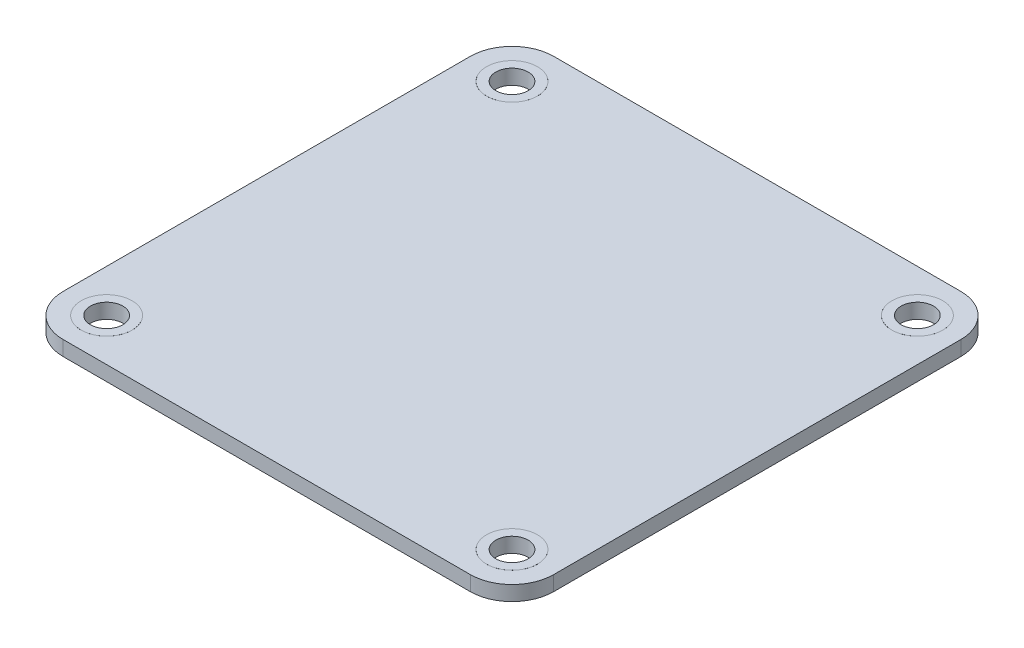
ISO-10303-21;
HEADER;
FILE_DESCRIPTION(('STEP AP214'),'2;1');
FILE_NAME('part.step','',(''),(''),'','','');
FILE_SCHEMA(('AUTOMOTIVE_DESIGN { 1 0 10303 214 1 1 1 1 }'));
ENDSEC;
DATA;
#1=APPLICATION_CONTEXT('core data for automotive mechanical design processes');
#2=APPLICATION_PROTOCOL_DEFINITION('international standard','automotive_design',2000,#1);
#3=PRODUCT_CONTEXT('',#1,'mechanical');
#4=PRODUCT('Part','Part','',(#3));
#5=PRODUCT_RELATED_PRODUCT_CATEGORY('part','',(#4));
#6=PRODUCT_DEFINITION_FORMATION('','',#4);
#7=PRODUCT_DEFINITION_CONTEXT('part definition',#1,'design');
#8=PRODUCT_DEFINITION('design','',#6,#7);
#9=PRODUCT_DEFINITION_SHAPE('','',#8);
#10=(LENGTH_UNIT() NAMED_UNIT(*) SI_UNIT(.MILLI.,.METRE.));
#11=(NAMED_UNIT(*) PLANE_ANGLE_UNIT() SI_UNIT($,.RADIAN.));
#12=(NAMED_UNIT(*) SI_UNIT($,.STERADIAN.) SOLID_ANGLE_UNIT());
#13=UNCERTAINTY_MEASURE_WITH_UNIT(LENGTH_MEASURE(1.E-05),#10,'distance_accuracy_value','');
#14=(GEOMETRIC_REPRESENTATION_CONTEXT(3) GLOBAL_UNCERTAINTY_ASSIGNED_CONTEXT((#13)) GLOBAL_UNIT_ASSIGNED_CONTEXT((#10,
#11,#12)) REPRESENTATION_CONTEXT('',''));
#15=CARTESIAN_POINT('',(0.,0.,0.));
#16=DIRECTION('',(0.,0.,1.));
#17=DIRECTION('',(1.,0.,0.));
#18=AXIS2_PLACEMENT_3D('',#15,#16,#17);
#19=CARTESIAN_POINT('',(-22.,1.6,-22.));
#20=DIRECTION('',(0.,-1.,0.));
#21=DIRECTION('',(0.,0.,-1.));
#22=AXIS2_PLACEMENT_3D('',#19,#20,#21);
#23=PLANE('',#22);
#24=CARTESIAN_POINT('',(21.9,1.6,21.9));
#25=DIRECTION('',(0.,-1.,0.));
#26=DIRECTION('',(0.,0.,-1.));
#27=AXIS2_PLACEMENT_3D('',#24,#25,#26);
#28=CIRCLE('',#27,2.75);
#29=CARTESIAN_POINT('',(21.9,1.6,19.15));
#30=VERTEX_POINT('',#29);
#31=EDGE_CURVE('E43',#30,#30,#28,.F.);
#32=ORIENTED_EDGE('',*,*,#31,.F.);
#33=EDGE_LOOP('',(#32));
#34=FACE_BOUND('',#33,.T.);
#35=CARTESIAN_POINT('',(-21.9,1.6,-21.9));
#36=DIRECTION('',(0.,-1.,0.));
#37=DIRECTION('',(0.,0.,-1.));
#38=AXIS2_PLACEMENT_3D('',#35,#36,#37);
#39=CIRCLE('',#38,2.75);
#40=CARTESIAN_POINT('',(-21.9,1.6,-24.65));
#41=VERTEX_POINT('',#40);
#42=EDGE_CURVE('E163',#41,#41,#39,.F.);
#43=ORIENTED_EDGE('',*,*,#42,.F.);
#44=EDGE_LOOP('',(#43));
#45=FACE_BOUND('',#44,.T.);
#46=CARTESIAN_POINT('',(-22.,1.6,-22.));
#47=DIRECTION('',(0.,1.,0.));
#48=DIRECTION('',(0.,0.,-1.));
#49=AXIS2_PLACEMENT_3D('',#46,#47,#48);
#50=CIRCLE('',#49,4.5);
#51=CARTESIAN_POINT('',(-22.,1.6,-26.5));
#52=VERTEX_POINT('',#51);
#53=CARTESIAN_POINT('',(-26.5,1.6,-22.));
#54=VERTEX_POINT('',#53);
#55=EDGE_CURVE('E148',#52,#54,#50,.T.);
#56=ORIENTED_EDGE('',*,*,#55,.T.);
#57=DIRECTION('',(0.,0.,1.));
#58=VECTOR('',#57,1.);
#59=CARTESIAN_POINT('',(-26.5,1.6,22.));
#60=LINE('',#59,#58);
#61=CARTESIAN_POINT('',(-26.5,1.6,22.));
#62=VERTEX_POINT('',#61);
#63=EDGE_CURVE('E96',#54,#62,#60,.T.);
#64=ORIENTED_EDGE('',*,*,#63,.T.);
#65=CARTESIAN_POINT('',(-22.,1.6,22.));
#66=DIRECTION('',(0.,1.,0.));
#67=DIRECTION('',(0.,0.,-1.));
#68=AXIS2_PLACEMENT_3D('',#65,#66,#67);
#69=CIRCLE('',#68,4.5);
#70=CARTESIAN_POINT('',(-22.,1.6,26.5));
#71=VERTEX_POINT('',#70);
#72=EDGE_CURVE('E218',#62,#71,#69,.T.);
#73=ORIENTED_EDGE('',*,*,#72,.T.);
#74=DIRECTION('',(1.,0.,0.));
#75=VECTOR('',#74,1.);
#76=CARTESIAN_POINT('',(22.,1.6,26.5));
#77=LINE('',#76,#75);
#78=CARTESIAN_POINT('',(22.,1.6,26.5));
#79=VERTEX_POINT('',#78);
#80=EDGE_CURVE('E220',#71,#79,#77,.T.);
#81=ORIENTED_EDGE('',*,*,#80,.T.);
#82=CARTESIAN_POINT('',(22.,1.6,22.));
#83=DIRECTION('',(0.,1.,0.));
#84=DIRECTION('',(0.,0.,-1.));
#85=AXIS2_PLACEMENT_3D('',#82,#83,#84);
#86=CIRCLE('',#85,4.5);
#87=CARTESIAN_POINT('',(26.5,1.6,22.));
#88=VERTEX_POINT('',#87);
#89=EDGE_CURVE('E115',#79,#88,#86,.T.);
#90=ORIENTED_EDGE('',*,*,#89,.T.);
#91=DIRECTION('',(0.,0.,-1.));
#92=VECTOR('',#91,1.);
#93=CARTESIAN_POINT('',(26.5,1.6,22.));
#94=LINE('',#93,#92);
#95=CARTESIAN_POINT('',(26.5,1.6,-22.));
#96=VERTEX_POINT('',#95);
#97=EDGE_CURVE('E109',#88,#96,#94,.T.);
#98=ORIENTED_EDGE('',*,*,#97,.T.);
#99=CARTESIAN_POINT('',(22.,1.6,-22.));
#100=DIRECTION('',(0.,1.,0.));
#101=DIRECTION('',(0.,0.,-1.));
#102=AXIS2_PLACEMENT_3D('',#99,#100,#101);
#103=CIRCLE('',#102,4.5);
#104=CARTESIAN_POINT('',(22.,1.6,-26.5));
#105=VERTEX_POINT('',#104);
#106=EDGE_CURVE('E113',#96,#105,#103,.T.);
#107=ORIENTED_EDGE('',*,*,#106,.T.);
#108=DIRECTION('',(-1.,0.,0.));
#109=VECTOR('',#108,1.);
#110=CARTESIAN_POINT('',(22.,1.6,-26.5));
#111=LINE('',#110,#109);
#112=EDGE_CURVE('E52',#105,#52,#111,.T.);
#113=ORIENTED_EDGE('',*,*,#112,.T.);
#114=EDGE_LOOP('',(#56,#64,#73,#81,#90,#98,#107,#113));
#115=FACE_BOUND('',#114,.T.);
#116=CARTESIAN_POINT('',(21.9,1.6,-21.9));
#117=DIRECTION('',(0.,-1.,0.));
#118=DIRECTION('',(0.,0.,-1.));
#119=AXIS2_PLACEMENT_3D('',#116,#117,#118);
#120=CIRCLE('',#119,2.75);
#121=CARTESIAN_POINT('',(21.9,1.6,-24.65));
#122=VERTEX_POINT('',#121);
#123=EDGE_CURVE('E194',#122,#122,#120,.F.);
#124=ORIENTED_EDGE('',*,*,#123,.F.);
#125=EDGE_LOOP('',(#124));
#126=FACE_BOUND('',#125,.T.);
#127=CARTESIAN_POINT('',(-21.9,1.6,21.9));
#128=DIRECTION('',(0.,-1.,0.));
#129=DIRECTION('',(0.,0.,-1.));
#130=AXIS2_PLACEMENT_3D('',#127,#128,#129);
#131=CIRCLE('',#130,2.75);
#132=CARTESIAN_POINT('',(-21.9,1.6,19.15));
#133=VERTEX_POINT('',#132);
#134=EDGE_CURVE('E11',#133,#133,#131,.F.);
#135=ORIENTED_EDGE('',*,*,#134,.F.);
#136=EDGE_LOOP('',(#135));
#137=FACE_BOUND('',#136,.T.);
#138=ADVANCED_FACE('F33',(#34,#45,#115,#126,#137),#23,.F.);
#139=CARTESIAN_POINT('',(-22.,0.,-22.));
#140=DIRECTION('',(0.,-1.,0.));
#141=DIRECTION('',(0.,0.,-1.));
#142=AXIS2_PLACEMENT_3D('',#139,#140,#141);
#143=PLANE('',#142);
#144=CARTESIAN_POINT('',(21.9,0.,21.9));
#145=DIRECTION('',(0.,-1.,0.));
#146=DIRECTION('',(0.,0.,-1.));
#147=AXIS2_PLACEMENT_3D('',#144,#145,#146);
#148=CIRCLE('',#147,2.75);
#149=CARTESIAN_POINT('',(21.9,0.,19.15));
#150=VERTEX_POINT('',#149);
#151=EDGE_CURVE('E171',#150,#150,#148,.F.);
#152=ORIENTED_EDGE('',*,*,#151,.T.);
#153=EDGE_LOOP('',(#152));
#154=FACE_BOUND('',#153,.T.);
#155=CARTESIAN_POINT('',(-21.9,0.,-21.9));
#156=DIRECTION('',(0.,-1.,0.));
#157=DIRECTION('',(0.,0.,-1.));
#158=AXIS2_PLACEMENT_3D('',#155,#156,#157);
#159=CIRCLE('',#158,2.75);
#160=CARTESIAN_POINT('',(-21.9,0.,-24.65));
#161=VERTEX_POINT('',#160);
#162=EDGE_CURVE('E137',#161,#161,#159,.F.);
#163=ORIENTED_EDGE('',*,*,#162,.T.);
#164=EDGE_LOOP('',(#163));
#165=FACE_BOUND('',#164,.T.);
#166=CARTESIAN_POINT('',(-22.,0.,-22.));
#167=DIRECTION('',(0.,1.,0.));
#168=DIRECTION('',(0.,0.,-1.));
#169=AXIS2_PLACEMENT_3D('',#166,#167,#168);
#170=CIRCLE('',#169,4.5);
#171=CARTESIAN_POINT('',(-22.,0.,-26.5));
#172=VERTEX_POINT('',#171);
#173=CARTESIAN_POINT('',(-26.5,0.,-22.));
#174=VERTEX_POINT('',#173);
#175=EDGE_CURVE('E133',#172,#174,#170,.T.);
#176=ORIENTED_EDGE('',*,*,#175,.F.);
#177=DIRECTION('',(-1.,0.,0.));
#178=VECTOR('',#177,1.);
#179=CARTESIAN_POINT('',(22.,0.,-26.5));
#180=LINE('',#179,#178);
#181=CARTESIAN_POINT('',(22.,0.,-26.5));
#182=VERTEX_POINT('',#181);
#183=EDGE_CURVE('E87',#182,#172,#180,.T.);
#184=ORIENTED_EDGE('',*,*,#183,.F.);
#185=CARTESIAN_POINT('',(22.,0.,-22.));
#186=DIRECTION('',(0.,1.,0.));
#187=DIRECTION('',(0.,0.,-1.));
#188=AXIS2_PLACEMENT_3D('',#185,#186,#187);
#189=CIRCLE('',#188,4.5);
#190=CARTESIAN_POINT('',(26.5,0.,-22.));
#191=VERTEX_POINT('',#190);
#192=EDGE_CURVE('E81',#191,#182,#189,.T.);
#193=ORIENTED_EDGE('',*,*,#192,.F.);
#194=DIRECTION('',(0.,0.,-1.));
#195=VECTOR('',#194,1.);
#196=CARTESIAN_POINT('',(26.5,0.,22.));
#197=LINE('',#196,#195);
#198=CARTESIAN_POINT('',(26.5,0.,22.));
#199=VERTEX_POINT('',#198);
#200=EDGE_CURVE('E123',#199,#191,#197,.T.);
#201=ORIENTED_EDGE('',*,*,#200,.F.);
#202=CARTESIAN_POINT('',(22.,0.,22.));
#203=DIRECTION('',(0.,1.,0.));
#204=DIRECTION('',(0.,0.,-1.));
#205=AXIS2_PLACEMENT_3D('',#202,#203,#204);
#206=CIRCLE('',#205,4.5);
#207=CARTESIAN_POINT('',(22.,0.,26.5));
#208=VERTEX_POINT('',#207);
#209=EDGE_CURVE('E143',#208,#199,#206,.T.);
#210=ORIENTED_EDGE('',*,*,#209,.F.);
#211=DIRECTION('',(1.,0.,0.));
#212=VECTOR('',#211,1.);
#213=CARTESIAN_POINT('',(22.,0.,26.5));
#214=LINE('',#213,#212);
#215=CARTESIAN_POINT('',(-22.,0.,26.5));
#216=VERTEX_POINT('',#215);
#217=EDGE_CURVE('E141',#216,#208,#214,.T.);
#218=ORIENTED_EDGE('',*,*,#217,.F.);
#219=CARTESIAN_POINT('',(-22.,0.,22.));
#220=DIRECTION('',(0.,1.,0.));
#221=DIRECTION('',(0.,0.,-1.));
#222=AXIS2_PLACEMENT_3D('',#219,#220,#221);
#223=CIRCLE('',#222,4.5);
#224=CARTESIAN_POINT('',(-26.5,0.,22.));
#225=VERTEX_POINT('',#224);
#226=EDGE_CURVE('E139',#225,#216,#223,.T.);
#227=ORIENTED_EDGE('',*,*,#226,.F.);
#228=DIRECTION('',(0.,0.,1.));
#229=VECTOR('',#228,1.);
#230=CARTESIAN_POINT('',(-26.5,0.,22.));
#231=LINE('',#230,#229);
#232=EDGE_CURVE('E136',#174,#225,#231,.T.);
#233=ORIENTED_EDGE('',*,*,#232,.F.);
#234=EDGE_LOOP('',(#176,#184,#193,#201,#210,#218,#227,#233));
#235=FACE_BOUND('',#234,.T.);
#236=CARTESIAN_POINT('',(21.9,0.,-21.9));
#237=DIRECTION('',(0.,-1.,0.));
#238=DIRECTION('',(0.,0.,-1.));
#239=AXIS2_PLACEMENT_3D('',#236,#237,#238);
#240=CIRCLE('',#239,2.75);
#241=CARTESIAN_POINT('',(21.9,0.,-24.65));
#242=VERTEX_POINT('',#241);
#243=EDGE_CURVE('E167',#242,#242,#240,.F.);
#244=ORIENTED_EDGE('',*,*,#243,.T.);
#245=EDGE_LOOP('',(#244));
#246=FACE_BOUND('',#245,.T.);
#247=CARTESIAN_POINT('',(-21.9,0.,21.9));
#248=DIRECTION('',(0.,-1.,0.));
#249=DIRECTION('',(0.,0.,-1.));
#250=AXIS2_PLACEMENT_3D('',#247,#248,#249);
#251=CIRCLE('',#250,2.75);
#252=CARTESIAN_POINT('',(-21.9,0.,19.15));
#253=VERTEX_POINT('',#252);
#254=EDGE_CURVE('E37',#253,#253,#251,.F.);
#255=ORIENTED_EDGE('',*,*,#254,.T.);
#256=EDGE_LOOP('',(#255));
#257=FACE_BOUND('',#256,.T.);
#258=ADVANCED_FACE('F233',(#154,#165,#235,#246,#257),#143,.T.);
#259=CARTESIAN_POINT('',(-21.9,1.605,-21.9));
#260=DIRECTION('',(0.,-1.,0.));
#261=DIRECTION('',(0.,0.,-1.));
#262=AXIS2_PLACEMENT_3D('',#259,#260,#261);
#263=CYLINDRICAL_SURFACE('',#262,2.75);
#264=CARTESIAN_POINT('',(-21.9,1.605,-21.9));
#265=DIRECTION('',(0.,1.,0.));
#266=DIRECTION('',(0.,0.,1.));
#267=AXIS2_PLACEMENT_3D('',#264,#265,#266);
#268=CIRCLE('',#267,2.75);
#269=CARTESIAN_POINT('',(-21.9,1.605,-19.15));
#270=VERTEX_POINT('',#269);
#271=EDGE_CURVE('E166',#270,#270,#268,.T.);
#272=ORIENTED_EDGE('',*,*,#271,.F.);
#273=EDGE_LOOP('',(#272));
#274=FACE_BOUND('',#273,.T.);
#275=ORIENTED_EDGE('',*,*,#42,.T.);
#276=EDGE_LOOP('',(#275));
#277=FACE_BOUND('',#276,.T.);
#278=ADVANCED_FACE('F259',(#274,#277),#263,.T.);
#279=CARTESIAN_POINT('',(-21.9,1.605,-21.9));
#280=DIRECTION('',(0.,1.,0.));
#281=DIRECTION('',(0.,0.,1.));
#282=AXIS2_PLACEMENT_3D('',#279,#280,#281);
#283=PLANE('',#282);
#284=ORIENTED_EDGE('',*,*,#271,.T.);
#285=EDGE_LOOP('',(#284));
#286=FACE_BOUND('',#285,.T.);
#287=CARTESIAN_POINT('',(-21.9,1.605,-21.9));
#288=DIRECTION('',(0.,1.,0.));
#289=DIRECTION('',(0.,0.,1.));
#290=AXIS2_PLACEMENT_3D('',#287,#288,#289);
#291=CIRCLE('',#290,1.75);
#292=CARTESIAN_POINT('',(-21.9,1.605,-20.15));
#293=VERTEX_POINT('',#292);
#294=EDGE_CURVE('E204',#293,#293,#291,.T.);
#295=ORIENTED_EDGE('',*,*,#294,.F.);
#296=EDGE_LOOP('',(#295));
#297=FACE_BOUND('',#296,.T.);
#298=ADVANCED_FACE('F271',(#286,#297),#283,.T.);
#299=CARTESIAN_POINT('',(-21.9,-0.00500000000000001,-21.9));
#300=DIRECTION('',(0.,1.,0.));
#301=DIRECTION('',(0.,0.,1.));
#302=AXIS2_PLACEMENT_3D('',#299,#300,#301);
#303=PLANE('',#302);
#304=CARTESIAN_POINT('',(-21.9,-0.00500000000000001,-21.9));
#305=DIRECTION('',(0.,1.,0.));
#306=DIRECTION('',(0.,0.,1.));
#307=AXIS2_PLACEMENT_3D('',#304,#305,#306);
#308=CIRCLE('',#307,2.75);
#309=CARTESIAN_POINT('',(-21.9,-0.00500000000000001,-19.15));
#310=VERTEX_POINT('',#309);
#311=EDGE_CURVE('E207',#310,#310,#308,.T.);
#312=ORIENTED_EDGE('',*,*,#311,.F.);
#313=EDGE_LOOP('',(#312));
#314=FACE_BOUND('',#313,.T.);
#315=CARTESIAN_POINT('',(-21.9,-0.00500000000000001,-21.9));
#316=DIRECTION('',(0.,1.,0.));
#317=DIRECTION('',(0.,0.,1.));
#318=AXIS2_PLACEMENT_3D('',#315,#316,#317);
#319=CIRCLE('',#318,1.75);
#320=CARTESIAN_POINT('',(-21.9,-0.00500000000000001,-20.15));
#321=VERTEX_POINT('',#320);
#322=EDGE_CURVE('E169',#321,#321,#319,.T.);
#323=ORIENTED_EDGE('',*,*,#322,.T.);
#324=EDGE_LOOP('',(#323));
#325=FACE_BOUND('',#324,.T.);
#326=ADVANCED_FACE('F267',(#314,#325),#303,.F.);
#327=ORIENTED_EDGE('',*,*,#162,.F.);
#328=EDGE_LOOP('',(#327));
#329=FACE_BOUND('',#328,.T.);
#330=ORIENTED_EDGE('',*,*,#311,.T.);
#331=EDGE_LOOP('',(#330));
#332=FACE_BOUND('',#331,.T.);
#333=ADVANCED_FACE('F263',(#329,#332),#263,.T.);
#334=CARTESIAN_POINT('',(-21.9,1.605,-21.9));
#335=DIRECTION('',(0.,-1.,0.));
#336=DIRECTION('',(0.,0.,-1.));
#337=AXIS2_PLACEMENT_3D('',#334,#335,#336);
#338=CYLINDRICAL_SURFACE('',#337,1.75);
#339=ORIENTED_EDGE('',*,*,#294,.T.);
#340=EDGE_LOOP('',(#339));
#341=FACE_BOUND('',#340,.T.);
#342=ORIENTED_EDGE('',*,*,#322,.F.);
#343=EDGE_LOOP('',(#342));
#344=FACE_BOUND('',#343,.T.);
#345=ADVANCED_FACE('F266',(#341,#344),#338,.F.);
#346=CARTESIAN_POINT('',(-22.,1.6,-22.));
#347=DIRECTION('',(0.,-1.,0.));
#348=DIRECTION('',(0.,0.,-1.));
#349=AXIS2_PLACEMENT_3D('',#346,#347,#348);
#350=CYLINDRICAL_SURFACE('',#349,4.5);
#351=ORIENTED_EDGE('',*,*,#175,.T.);
#352=DIRECTION('',(0.,-1.,0.));
#353=VECTOR('',#352,1.);
#354=CARTESIAN_POINT('',(-26.5,1.6,-22.));
#355=LINE('',#354,#353);
#356=EDGE_CURVE('E161',#54,#174,#355,.T.);
#357=ORIENTED_EDGE('',*,*,#356,.F.);
#358=ORIENTED_EDGE('',*,*,#55,.F.);
#359=DIRECTION('',(0.,-1.,0.));
#360=VECTOR('',#359,1.);
#361=CARTESIAN_POINT('',(-22.,1.6,-26.5));
#362=LINE('',#361,#360);
#363=EDGE_CURVE('E129',#52,#172,#362,.T.);
#364=ORIENTED_EDGE('',*,*,#363,.T.);
#365=EDGE_LOOP('',(#351,#357,#358,#364));
#366=FACE_BOUND('',#365,.T.);
#367=ADVANCED_FACE('F35',(#366),#350,.T.);
#368=CARTESIAN_POINT('',(-26.5,1.6,22.));
#369=DIRECTION('',(1.,0.,0.));
#370=DIRECTION('',(0.,0.,-1.));
#371=AXIS2_PLACEMENT_3D('',#368,#369,#370);
#372=PLANE('',#371);
#373=ORIENTED_EDGE('',*,*,#232,.T.);
#374=DIRECTION('',(0.,-1.,0.));
#375=VECTOR('',#374,1.);
#376=CARTESIAN_POINT('',(-26.5,1.6,22.));
#377=LINE('',#376,#375);
#378=EDGE_CURVE('E158',#62,#225,#377,.T.);
#379=ORIENTED_EDGE('',*,*,#378,.F.);
#380=ORIENTED_EDGE('',*,*,#63,.F.);
#381=ORIENTED_EDGE('',*,*,#356,.T.);
#382=EDGE_LOOP('',(#373,#379,#380,#381));
#383=FACE_BOUND('',#382,.T.);
#384=ADVANCED_FACE('F515',(#383),#372,.F.);
#385=CARTESIAN_POINT('',(-22.,1.6,22.));
#386=DIRECTION('',(0.,-1.,0.));
#387=DIRECTION('',(0.,0.,-1.));
#388=AXIS2_PLACEMENT_3D('',#385,#386,#387);
#389=CYLINDRICAL_SURFACE('',#388,4.5);
#390=ORIENTED_EDGE('',*,*,#226,.T.);
#391=DIRECTION('',(0.,-1.,0.));
#392=VECTOR('',#391,1.);
#393=CARTESIAN_POINT('',(-22.,1.6,26.5));
#394=LINE('',#393,#392);
#395=EDGE_CURVE('E155',#71,#216,#394,.T.);
#396=ORIENTED_EDGE('',*,*,#395,.F.);
#397=ORIENTED_EDGE('',*,*,#72,.F.);
#398=ORIENTED_EDGE('',*,*,#378,.T.);
#399=EDGE_LOOP('',(#390,#396,#397,#398));
#400=FACE_BOUND('',#399,.T.);
#401=ADVANCED_FACE('F507',(#400),#389,.T.);
#402=CARTESIAN_POINT('',(22.,1.6,26.5));
#403=DIRECTION('',(0.,0.,-1.));
#404=DIRECTION('',(-1.,0.,0.));
#405=AXIS2_PLACEMENT_3D('',#402,#403,#404);
#406=PLANE('',#405);
#407=ORIENTED_EDGE('',*,*,#217,.T.);
#408=DIRECTION('',(0.,-1.,0.));
#409=VECTOR('',#408,1.);
#410=CARTESIAN_POINT('',(22.,1.6,26.5));
#411=LINE('',#410,#409);
#412=EDGE_CURVE('E152',#79,#208,#411,.T.);
#413=ORIENTED_EDGE('',*,*,#412,.F.);
#414=ORIENTED_EDGE('',*,*,#80,.F.);
#415=ORIENTED_EDGE('',*,*,#395,.T.);
#416=EDGE_LOOP('',(#407,#413,#414,#415));
#417=FACE_BOUND('',#416,.T.);
#418=ADVANCED_FACE('F226',(#417),#406,.F.);
#419=CARTESIAN_POINT('',(22.,1.6,22.));
#420=DIRECTION('',(0.,-1.,0.));
#421=DIRECTION('',(0.,0.,-1.));
#422=AXIS2_PLACEMENT_3D('',#419,#420,#421);
#423=CYLINDRICAL_SURFACE('',#422,4.5);
#424=ORIENTED_EDGE('',*,*,#209,.T.);
#425=DIRECTION('',(0.,-1.,0.));
#426=VECTOR('',#425,1.);
#427=CARTESIAN_POINT('',(26.5,1.6,22.));
#428=LINE('',#427,#426);
#429=EDGE_CURVE('E124',#88,#199,#428,.T.);
#430=ORIENTED_EDGE('',*,*,#429,.F.);
#431=ORIENTED_EDGE('',*,*,#89,.F.);
#432=ORIENTED_EDGE('',*,*,#412,.T.);
#433=EDGE_LOOP('',(#424,#430,#431,#432));
#434=FACE_BOUND('',#433,.T.);
#435=ADVANCED_FACE('F230',(#434),#423,.T.);
#436=CARTESIAN_POINT('',(26.5,1.6,22.));
#437=DIRECTION('',(-1.,0.,0.));
#438=DIRECTION('',(0.,0.,1.));
#439=AXIS2_PLACEMENT_3D('',#436,#437,#438);
#440=PLANE('',#439);
#441=ORIENTED_EDGE('',*,*,#200,.T.);
#442=DIRECTION('',(0.,-1.,0.));
#443=VECTOR('',#442,1.);
#444=CARTESIAN_POINT('',(26.5,1.6,-22.));
#445=LINE('',#444,#443);
#446=EDGE_CURVE('E120',#96,#191,#445,.T.);
#447=ORIENTED_EDGE('',*,*,#446,.F.);
#448=ORIENTED_EDGE('',*,*,#97,.F.);
#449=ORIENTED_EDGE('',*,*,#429,.T.);
#450=EDGE_LOOP('',(#441,#447,#448,#449));
#451=FACE_BOUND('',#450,.T.);
#452=ADVANCED_FACE('F121',(#451),#440,.F.);
#453=CARTESIAN_POINT('',(22.,1.6,-22.));
#454=DIRECTION('',(0.,-1.,0.));
#455=DIRECTION('',(0.,0.,-1.));
#456=AXIS2_PLACEMENT_3D('',#453,#454,#455);
#457=CYLINDRICAL_SURFACE('',#456,4.5);
#458=ORIENTED_EDGE('',*,*,#192,.T.);
#459=DIRECTION('',(0.,-1.,0.));
#460=VECTOR('',#459,1.);
#461=CARTESIAN_POINT('',(22.,1.6,-26.5));
#462=LINE('',#461,#460);
#463=EDGE_CURVE('E125',#105,#182,#462,.T.);
#464=ORIENTED_EDGE('',*,*,#463,.F.);
#465=ORIENTED_EDGE('',*,*,#106,.F.);
#466=ORIENTED_EDGE('',*,*,#446,.T.);
#467=EDGE_LOOP('',(#458,#464,#465,#466));
#468=FACE_BOUND('',#467,.T.);
#469=ADVANCED_FACE('F127',(#468),#457,.T.);
#470=CARTESIAN_POINT('',(22.,1.6,-26.5));
#471=DIRECTION('',(0.,0.,1.));
#472=DIRECTION('',(1.,0.,0.));
#473=AXIS2_PLACEMENT_3D('',#470,#471,#472);
#474=PLANE('',#473);
#475=ORIENTED_EDGE('',*,*,#183,.T.);
#476=ORIENTED_EDGE('',*,*,#363,.F.);
#477=ORIENTED_EDGE('',*,*,#112,.F.);
#478=ORIENTED_EDGE('',*,*,#463,.T.);
#479=EDGE_LOOP('',(#475,#476,#477,#478));
#480=FACE_BOUND('',#479,.T.);
#481=ADVANCED_FACE('F239',(#480),#474,.F.);
#482=CARTESIAN_POINT('',(21.9,1.605,-21.9));
#483=DIRECTION('',(0.,-1.,0.));
#484=DIRECTION('',(0.,0.,-1.));
#485=AXIS2_PLACEMENT_3D('',#482,#483,#484);
#486=CYLINDRICAL_SURFACE('',#485,2.75);
#487=CARTESIAN_POINT('',(21.9,1.605,-21.9));
#488=DIRECTION('',(0.,1.,0.));
#489=DIRECTION('',(0.,0.,1.));
#490=AXIS2_PLACEMENT_3D('',#487,#488,#489);
#491=CIRCLE('',#490,2.75);
#492=CARTESIAN_POINT('',(21.9,1.605,-19.15));
#493=VERTEX_POINT('',#492);
#494=EDGE_CURVE('E170',#493,#493,#491,.T.);
#495=ORIENTED_EDGE('',*,*,#494,.F.);
#496=EDGE_LOOP('',(#495));
#497=FACE_BOUND('',#496,.T.);
#498=ORIENTED_EDGE('',*,*,#123,.T.);
#499=EDGE_LOOP('',(#498));
#500=FACE_BOUND('',#499,.T.);
#501=ADVANCED_FACE('F241',(#497,#500),#486,.T.);
#502=CARTESIAN_POINT('',(21.9,1.605,-21.9));
#503=DIRECTION('',(0.,1.,0.));
#504=DIRECTION('',(0.,0.,1.));
#505=AXIS2_PLACEMENT_3D('',#502,#503,#504);
#506=PLANE('',#505);
#507=ORIENTED_EDGE('',*,*,#494,.T.);
#508=EDGE_LOOP('',(#507));
#509=FACE_BOUND('',#508,.T.);
#510=CARTESIAN_POINT('',(21.9,1.605,-21.9));
#511=DIRECTION('',(0.,1.,0.));
#512=DIRECTION('',(0.,0.,1.));
#513=AXIS2_PLACEMENT_3D('',#510,#511,#512);
#514=CIRCLE('',#513,1.75);
#515=CARTESIAN_POINT('',(21.9,1.605,-20.15));
#516=VERTEX_POINT('',#515);
#517=EDGE_CURVE('E178',#516,#516,#514,.T.);
#518=ORIENTED_EDGE('',*,*,#517,.F.);
#519=EDGE_LOOP('',(#518));
#520=FACE_BOUND('',#519,.T.);
#521=ADVANCED_FACE('F247',(#509,#520),#506,.T.);
#522=CARTESIAN_POINT('',(21.9,-0.00500000000000001,-21.9));
#523=DIRECTION('',(0.,1.,0.));
#524=DIRECTION('',(0.,0.,1.));
#525=AXIS2_PLACEMENT_3D('',#522,#523,#524);
#526=PLANE('',#525);
#527=CARTESIAN_POINT('',(21.9,-0.00500000000000001,-21.9));
#528=DIRECTION('',(0.,1.,0.));
#529=DIRECTION('',(0.,0.,1.));
#530=AXIS2_PLACEMENT_3D('',#527,#528,#529);
#531=CIRCLE('',#530,2.75);
#532=CARTESIAN_POINT('',(21.9,-0.00500000000000001,-19.15));
#533=VERTEX_POINT('',#532);
#534=EDGE_CURVE('E196',#533,#533,#531,.T.);
#535=ORIENTED_EDGE('',*,*,#534,.F.);
#536=EDGE_LOOP('',(#535));
#537=FACE_BOUND('',#536,.T.);
#538=CARTESIAN_POINT('',(21.9,-0.00500000000000001,-21.9));
#539=DIRECTION('',(0.,1.,0.));
#540=DIRECTION('',(0.,0.,1.));
#541=AXIS2_PLACEMENT_3D('',#538,#539,#540);
#542=CIRCLE('',#541,1.75);
#543=CARTESIAN_POINT('',(21.9,-0.00500000000000001,-20.15));
#544=VERTEX_POINT('',#543);
#545=EDGE_CURVE('E173',#544,#544,#542,.T.);
#546=ORIENTED_EDGE('',*,*,#545,.T.);
#547=EDGE_LOOP('',(#546));
#548=FACE_BOUND('',#547,.T.);
#549=ADVANCED_FACE('F281',(#537,#548),#526,.F.);
#550=ORIENTED_EDGE('',*,*,#243,.F.);
#551=EDGE_LOOP('',(#550));
#552=FACE_BOUND('',#551,.T.);
#553=ORIENTED_EDGE('',*,*,#534,.T.);
#554=EDGE_LOOP('',(#553));
#555=FACE_BOUND('',#554,.T.);
#556=ADVANCED_FACE('F250',(#552,#555),#486,.T.);
#557=CARTESIAN_POINT('',(21.9,1.605,-21.9));
#558=DIRECTION('',(0.,-1.,0.));
#559=DIRECTION('',(0.,0.,-1.));
#560=AXIS2_PLACEMENT_3D('',#557,#558,#559);
#561=CYLINDRICAL_SURFACE('',#560,1.75);
#562=ORIENTED_EDGE('',*,*,#517,.T.);
#563=EDGE_LOOP('',(#562));
#564=FACE_BOUND('',#563,.T.);
#565=ORIENTED_EDGE('',*,*,#545,.F.);
#566=EDGE_LOOP('',(#565));
#567=FACE_BOUND('',#566,.T.);
#568=ADVANCED_FACE('F280',(#564,#567),#561,.F.);
#569=CARTESIAN_POINT('',(21.9,1.605,21.9));
#570=DIRECTION('',(0.,-1.,0.));
#571=DIRECTION('',(0.,0.,-1.));
#572=AXIS2_PLACEMENT_3D('',#569,#570,#571);
#573=CYLINDRICAL_SURFACE('',#572,2.75);
#574=CARTESIAN_POINT('',(21.9,1.605,21.9));
#575=DIRECTION('',(0.,1.,0.));
#576=DIRECTION('',(0.,0.,1.));
#577=AXIS2_PLACEMENT_3D('',#574,#575,#576);
#578=CIRCLE('',#577,2.75);
#579=CARTESIAN_POINT('',(21.9,1.605,24.65));
#580=VERTEX_POINT('',#579);
#581=EDGE_CURVE('E174',#580,#580,#578,.T.);
#582=ORIENTED_EDGE('',*,*,#581,.F.);
#583=EDGE_LOOP('',(#582));
#584=FACE_BOUND('',#583,.T.);
#585=ORIENTED_EDGE('',*,*,#31,.T.);
#586=EDGE_LOOP('',(#585));
#587=FACE_BOUND('',#586,.T.);
#588=ADVANCED_FACE('F291',(#584,#587),#573,.T.);
#589=CARTESIAN_POINT('',(21.9,1.605,21.9));
#590=DIRECTION('',(0.,1.,0.));
#591=DIRECTION('',(0.,0.,1.));
#592=AXIS2_PLACEMENT_3D('',#589,#590,#591);
#593=PLANE('',#592);
#594=ORIENTED_EDGE('',*,*,#581,.T.);
#595=EDGE_LOOP('',(#594));
#596=FACE_BOUND('',#595,.T.);
#597=CARTESIAN_POINT('',(21.9,1.605,21.9));
#598=DIRECTION('',(0.,1.,0.));
#599=DIRECTION('',(0.,0.,1.));
#600=AXIS2_PLACEMENT_3D('',#597,#598,#599);
#601=CIRCLE('',#600,1.75);
#602=CARTESIAN_POINT('',(21.9,1.605,23.65));
#603=VERTEX_POINT('',#602);
#604=EDGE_CURVE('E186',#603,#603,#601,.T.);
#605=ORIENTED_EDGE('',*,*,#604,.F.);
#606=EDGE_LOOP('',(#605));
#607=FACE_BOUND('',#606,.T.);
#608=ADVANCED_FACE('F301',(#596,#607),#593,.T.);
#609=CARTESIAN_POINT('',(21.9,-0.00500000000000001,21.9));
#610=DIRECTION('',(0.,1.,0.));
#611=DIRECTION('',(0.,0.,1.));
#612=AXIS2_PLACEMENT_3D('',#609,#610,#611);
#613=PLANE('',#612);
#614=CARTESIAN_POINT('',(21.9,-0.00500000000000001,21.9));
#615=DIRECTION('',(0.,1.,0.));
#616=DIRECTION('',(0.,0.,1.));
#617=AXIS2_PLACEMENT_3D('',#614,#615,#616);
#618=CIRCLE('',#617,2.75);
#619=CARTESIAN_POINT('',(21.9,-0.00500000000000001,24.65));
#620=VERTEX_POINT('',#619);
#621=EDGE_CURVE('E181',#620,#620,#618,.T.);
#622=ORIENTED_EDGE('',*,*,#621,.F.);
#623=EDGE_LOOP('',(#622));
#624=FACE_BOUND('',#623,.T.);
#625=CARTESIAN_POINT('',(21.9,-0.00500000000000001,21.9));
#626=DIRECTION('',(0.,1.,0.));
#627=DIRECTION('',(0.,0.,1.));
#628=AXIS2_PLACEMENT_3D('',#625,#626,#627);
#629=CIRCLE('',#628,1.75);
#630=CARTESIAN_POINT('',(21.9,-0.00500000000000001,23.65));
#631=VERTEX_POINT('',#630);
#632=EDGE_CURVE('E189',#631,#631,#629,.T.);
#633=ORIENTED_EDGE('',*,*,#632,.T.);
#634=EDGE_LOOP('',(#633));
#635=FACE_BOUND('',#634,.T.);
#636=ADVANCED_FACE('F297',(#624,#635),#613,.F.);
#637=ORIENTED_EDGE('',*,*,#151,.F.);
#638=EDGE_LOOP('',(#637));
#639=FACE_BOUND('',#638,.T.);
#640=ORIENTED_EDGE('',*,*,#621,.T.);
#641=EDGE_LOOP('',(#640));
#642=FACE_BOUND('',#641,.T.);
#643=ADVANCED_FACE('F293',(#639,#642),#573,.T.);
#644=CARTESIAN_POINT('',(21.9,1.605,21.9));
#645=DIRECTION('',(0.,-1.,0.));
#646=DIRECTION('',(0.,0.,-1.));
#647=AXIS2_PLACEMENT_3D('',#644,#645,#646);
#648=CYLINDRICAL_SURFACE('',#647,1.75);
#649=ORIENTED_EDGE('',*,*,#604,.T.);
#650=EDGE_LOOP('',(#649));
#651=FACE_BOUND('',#650,.T.);
#652=ORIENTED_EDGE('',*,*,#632,.F.);
#653=EDGE_LOOP('',(#652));
#654=FACE_BOUND('',#653,.T.);
#655=ADVANCED_FACE('F296',(#651,#654),#648,.F.);
#656=CARTESIAN_POINT('',(-21.9,1.605,21.9));
#657=DIRECTION('',(0.,-1.,0.));
#658=DIRECTION('',(0.,0.,-1.));
#659=AXIS2_PLACEMENT_3D('',#656,#657,#658);
#660=CYLINDRICAL_SURFACE('',#659,2.75);
#661=CARTESIAN_POINT('',(-21.9,1.605,21.9));
#662=DIRECTION('',(0.,1.,0.));
#663=DIRECTION('',(0.,0.,1.));
#664=AXIS2_PLACEMENT_3D('',#661,#662,#663);
#665=CIRCLE('',#664,2.75);
#666=CARTESIAN_POINT('',(-21.9,1.605,24.65));
#667=VERTEX_POINT('',#666);
#668=EDGE_CURVE('E338',#667,#667,#665,.T.);
#669=ORIENTED_EDGE('',*,*,#668,.F.);
#670=EDGE_LOOP('',(#669));
#671=FACE_BOUND('',#670,.T.);
#672=ORIENTED_EDGE('',*,*,#134,.T.);
#673=EDGE_LOOP('',(#672));
#674=FACE_BOUND('',#673,.T.);
#675=ADVANCED_FACE('F307',(#671,#674),#660,.T.);
#676=CARTESIAN_POINT('',(-21.9,1.605,21.9));
#677=DIRECTION('',(0.,1.,0.));
#678=DIRECTION('',(0.,0.,1.));
#679=AXIS2_PLACEMENT_3D('',#676,#677,#678);
#680=PLANE('',#679);
#681=ORIENTED_EDGE('',*,*,#668,.T.);
#682=EDGE_LOOP('',(#681));
#683=FACE_BOUND('',#682,.T.);
#684=CARTESIAN_POINT('',(-21.9,1.605,21.9));
#685=DIRECTION('',(0.,1.,0.));
#686=DIRECTION('',(0.,0.,1.));
#687=AXIS2_PLACEMENT_3D('',#684,#685,#686);
#688=CIRCLE('',#687,1.75);
#689=CARTESIAN_POINT('',(-21.9,1.605,23.65));
#690=VERTEX_POINT('',#689);
#691=EDGE_CURVE('E329',#690,#690,#688,.T.);
#692=ORIENTED_EDGE('',*,*,#691,.F.);
#693=EDGE_LOOP('',(#692));
#694=FACE_BOUND('',#693,.T.);
#695=ADVANCED_FACE('F317',(#683,#694),#680,.T.);
#696=CARTESIAN_POINT('',(-21.9,-0.00500000000000001,21.9));
#697=DIRECTION('',(0.,1.,0.));
#698=DIRECTION('',(0.,0.,1.));
#699=AXIS2_PLACEMENT_3D('',#696,#697,#698);
#700=PLANE('',#699);
#701=CARTESIAN_POINT('',(-21.9,-0.00500000000000001,21.9));
#702=DIRECTION('',(0.,1.,0.));
#703=DIRECTION('',(0.,0.,1.));
#704=AXIS2_PLACEMENT_3D('',#701,#702,#703);
#705=CIRCLE('',#704,2.75);
#706=CARTESIAN_POINT('',(-21.9,-0.00500000000000001,24.65));
#707=VERTEX_POINT('',#706);
#708=EDGE_CURVE('E335',#707,#707,#705,.T.);
#709=ORIENTED_EDGE('',*,*,#708,.F.);
#710=EDGE_LOOP('',(#709));
#711=FACE_BOUND('',#710,.T.);
#712=CARTESIAN_POINT('',(-21.9,-0.00500000000000001,21.9));
#713=DIRECTION('',(0.,1.,0.));
#714=DIRECTION('',(0.,0.,1.));
#715=AXIS2_PLACEMENT_3D('',#712,#713,#714);
#716=CIRCLE('',#715,1.75);
#717=CARTESIAN_POINT('',(-21.9,-0.00500000000000001,23.65));
#718=VERTEX_POINT('',#717);
#719=EDGE_CURVE('E332',#718,#718,#716,.T.);
#720=ORIENTED_EDGE('',*,*,#719,.T.);
#721=EDGE_LOOP('',(#720));
#722=FACE_BOUND('',#721,.T.);
#723=ADVANCED_FACE('F313',(#711,#722),#700,.F.);
#724=ORIENTED_EDGE('',*,*,#254,.F.);
#725=EDGE_LOOP('',(#724));
#726=FACE_BOUND('',#725,.T.);
#727=ORIENTED_EDGE('',*,*,#708,.T.);
#728=EDGE_LOOP('',(#727));
#729=FACE_BOUND('',#728,.T.);
#730=ADVANCED_FACE('F309',(#726,#729),#660,.T.);
#731=CARTESIAN_POINT('',(-21.9,1.605,21.9));
#732=DIRECTION('',(0.,-1.,0.));
#733=DIRECTION('',(0.,0.,-1.));
#734=AXIS2_PLACEMENT_3D('',#731,#732,#733);
#735=CYLINDRICAL_SURFACE('',#734,1.75);
#736=ORIENTED_EDGE('',*,*,#691,.T.);
#737=EDGE_LOOP('',(#736));
#738=FACE_BOUND('',#737,.T.);
#739=ORIENTED_EDGE('',*,*,#719,.F.);
#740=EDGE_LOOP('',(#739));
#741=FACE_BOUND('',#740,.T.);
#742=ADVANCED_FACE('F312',(#738,#741),#735,.F.);
#743=CLOSED_SHELL('',(#138,#258,#278,#298,#326,#333,#345,#367,#384,#401,#418,#435,#452,#469,
#481,#501,#521,#549,#556,#568,#588,#608,#636,#643,#655,#675,#695,#723,#730,#742));
#744=MANIFOLD_SOLID_BREP('B2',#743);
#745=ADVANCED_BREP_SHAPE_REPRESENTATION('',(#18,#744),#14);
#746=SHAPE_DEFINITION_REPRESENTATION(#9,#745);
ENDSEC;
END-ISO-10303-21;
